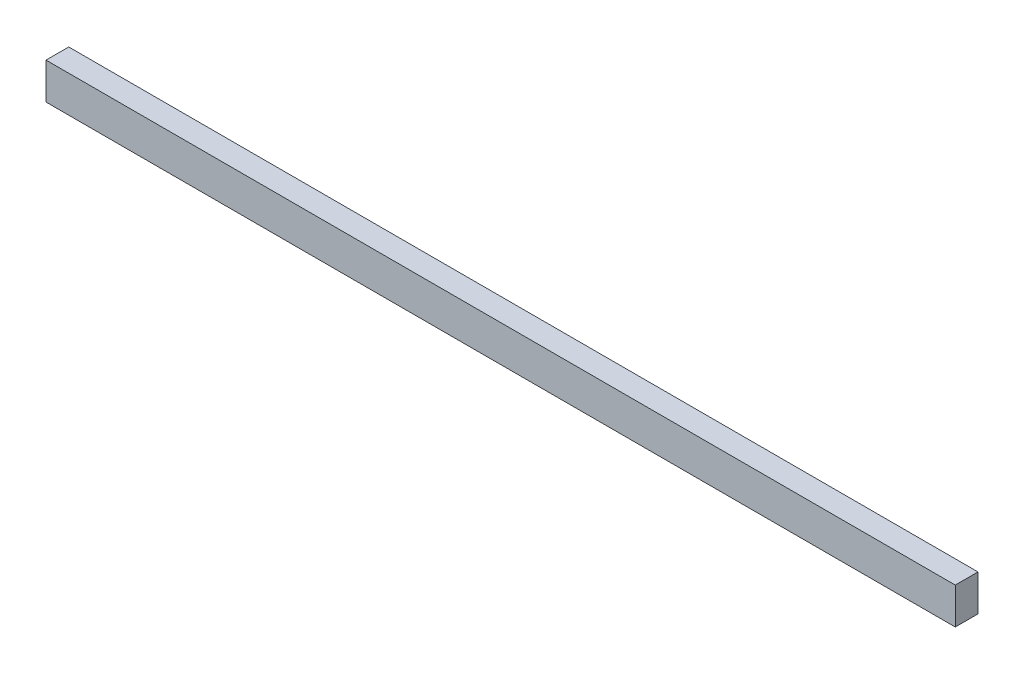
ISO-10303-21;
HEADER;
FILE_DESCRIPTION(('STEP AP214'),'2;1');
FILE_NAME('part.step','',(''),(''),'','','');
FILE_SCHEMA(('AUTOMOTIVE_DESIGN { 1 0 10303 214 1 1 1 1 }'));
ENDSEC;
DATA;
#1=APPLICATION_CONTEXT('core data for automotive mechanical design processes');
#2=APPLICATION_PROTOCOL_DEFINITION('international standard','automotive_design',2000,#1);
#3=PRODUCT_CONTEXT('',#1,'mechanical');
#4=PRODUCT('Part','Part','',(#3));
#5=PRODUCT_RELATED_PRODUCT_CATEGORY('part','',(#4));
#6=PRODUCT_DEFINITION_FORMATION('','',#4);
#7=PRODUCT_DEFINITION_CONTEXT('part definition',#1,'design');
#8=PRODUCT_DEFINITION('design','',#6,#7);
#9=PRODUCT_DEFINITION_SHAPE('','',#8);
#10=(LENGTH_UNIT() NAMED_UNIT(*) SI_UNIT(.MILLI.,.METRE.));
#11=(NAMED_UNIT(*) PLANE_ANGLE_UNIT() SI_UNIT($,.RADIAN.));
#12=(NAMED_UNIT(*) SI_UNIT($,.STERADIAN.) SOLID_ANGLE_UNIT());
#13=UNCERTAINTY_MEASURE_WITH_UNIT(LENGTH_MEASURE(1.E-05),#10,'distance_accuracy_value','');
#14=(GEOMETRIC_REPRESENTATION_CONTEXT(3) GLOBAL_UNCERTAINTY_ASSIGNED_CONTEXT((#13)) GLOBAL_UNIT_ASSIGNED_CONTEXT((#10,
#11,#12)) REPRESENTATION_CONTEXT('',''));
#15=CARTESIAN_POINT('',(0.,0.,0.));
#16=DIRECTION('',(0.,0.,1.));
#17=DIRECTION('',(1.,0.,0.));
#18=AXIS2_PLACEMENT_3D('',#15,#16,#17);
#19=CARTESIAN_POINT('',(0.,0.,6.35));
#20=DIRECTION('',(-1.,0.,0.));
#21=DIRECTION('',(0.,0.,1.));
#22=AXIS2_PLACEMENT_3D('',#19,#20,#21);
#23=PLANE('',#22);
#24=DIRECTION('',(0.,1.,0.));
#25=VECTOR('',#24,1.);
#26=CARTESIAN_POINT('',(0.,0.,0.));
#27=LINE('',#26,#25);
#28=CARTESIAN_POINT('',(0.,0.,0.));
#29=VERTEX_POINT('',#28);
#30=CARTESIAN_POINT('',(0.,10.16,0.));
#31=VERTEX_POINT('',#30);
#32=EDGE_CURVE('E110',#29,#31,#27,.T.);
#33=ORIENTED_EDGE('',*,*,#32,.F.);
#34=DIRECTION('',(0.,0.,-1.));
#35=VECTOR('',#34,1.);
#36=CARTESIAN_POINT('',(0.,0.,6.35));
#37=LINE('',#36,#35);
#38=CARTESIAN_POINT('',(0.,0.,6.35));
#39=VERTEX_POINT('',#38);
#40=EDGE_CURVE('E11',#39,#29,#37,.T.);
#41=ORIENTED_EDGE('',*,*,#40,.F.);
#42=DIRECTION('',(0.,1.,0.));
#43=VECTOR('',#42,1.);
#44=CARTESIAN_POINT('',(0.,0.,6.35));
#45=LINE('',#44,#43);
#46=CARTESIAN_POINT('',(0.,10.16,6.35));
#47=VERTEX_POINT('',#46);
#48=EDGE_CURVE('E103',#39,#47,#45,.T.);
#49=ORIENTED_EDGE('',*,*,#48,.T.);
#50=DIRECTION('',(0.,0.,-1.));
#51=VECTOR('',#50,1.);
#52=CARTESIAN_POINT('',(0.,10.16,6.35));
#53=LINE('',#52,#51);
#54=EDGE_CURVE('E42',#47,#31,#53,.T.);
#55=ORIENTED_EDGE('',*,*,#54,.T.);
#56=EDGE_LOOP('',(#33,#41,#49,#55));
#57=FACE_BOUND('',#56,.T.);
#58=ADVANCED_FACE('F39',(#57),#23,.T.);
#59=CARTESIAN_POINT('',(0.,0.,6.35));
#60=DIRECTION('',(0.,1.,0.));
#61=DIRECTION('',(0.,0.,1.));
#62=AXIS2_PLACEMENT_3D('',#59,#60,#61);
#63=PLANE('',#62);
#64=DIRECTION('',(1.,0.,0.));
#65=VECTOR('',#64,1.);
#66=CARTESIAN_POINT('',(0.,0.,0.));
#67=LINE('',#66,#65);
#68=CARTESIAN_POINT('',(254.,0.,0.));
#69=VERTEX_POINT('',#68);
#70=EDGE_CURVE('E73',#29,#69,#67,.T.);
#71=ORIENTED_EDGE('',*,*,#70,.T.);
#72=DIRECTION('',(0.,0.,-1.));
#73=VECTOR('',#72,1.);
#74=CARTESIAN_POINT('',(254.,0.,6.35));
#75=LINE('',#74,#73);
#76=CARTESIAN_POINT('',(254.,0.,6.35));
#77=VERTEX_POINT('',#76);
#78=EDGE_CURVE('E49',#77,#69,#75,.T.);
#79=ORIENTED_EDGE('',*,*,#78,.F.);
#80=DIRECTION('',(1.,0.,0.));
#81=VECTOR('',#80,1.);
#82=CARTESIAN_POINT('',(0.,0.,6.35));
#83=LINE('',#82,#81);
#84=EDGE_CURVE('E90',#39,#77,#83,.T.);
#85=ORIENTED_EDGE('',*,*,#84,.F.);
#86=ORIENTED_EDGE('',*,*,#40,.T.);
#87=EDGE_LOOP('',(#71,#79,#85,#86));
#88=FACE_BOUND('',#87,.T.);
#89=ADVANCED_FACE('F126',(#88),#63,.F.);
#90=CARTESIAN_POINT('',(254.,0.,6.35));
#91=DIRECTION('',(-1.,0.,0.));
#92=DIRECTION('',(0.,0.,1.));
#93=AXIS2_PLACEMENT_3D('',#90,#91,#92);
#94=PLANE('',#93);
#95=DIRECTION('',(0.,1.,0.));
#96=VECTOR('',#95,1.);
#97=CARTESIAN_POINT('',(254.,0.,0.));
#98=LINE('',#97,#96);
#99=CARTESIAN_POINT('',(254.,10.16,0.));
#100=VERTEX_POINT('',#99);
#101=EDGE_CURVE('E98',#69,#100,#98,.T.);
#102=ORIENTED_EDGE('',*,*,#101,.T.);
#103=DIRECTION('',(0.,0.,-1.));
#104=VECTOR('',#103,1.);
#105=CARTESIAN_POINT('',(254.,10.16,6.35));
#106=LINE('',#105,#104);
#107=CARTESIAN_POINT('',(254.,10.16,6.35));
#108=VERTEX_POINT('',#107);
#109=EDGE_CURVE('E95',#108,#100,#106,.T.);
#110=ORIENTED_EDGE('',*,*,#109,.F.);
#111=DIRECTION('',(0.,1.,0.));
#112=VECTOR('',#111,1.);
#113=CARTESIAN_POINT('',(254.,0.,6.35));
#114=LINE('',#113,#112);
#115=EDGE_CURVE('E85',#77,#108,#114,.T.);
#116=ORIENTED_EDGE('',*,*,#115,.F.);
#117=ORIENTED_EDGE('',*,*,#78,.T.);
#118=EDGE_LOOP('',(#102,#110,#116,#117));
#119=FACE_BOUND('',#118,.T.);
#120=ADVANCED_FACE('F96',(#119),#94,.F.);
#121=CARTESIAN_POINT('',(0.,10.16,6.35));
#122=DIRECTION('',(0.,1.,0.));
#123=DIRECTION('',(0.,0.,1.));
#124=AXIS2_PLACEMENT_3D('',#121,#122,#123);
#125=PLANE('',#124);
#126=DIRECTION('',(1.,0.,0.));
#127=VECTOR('',#126,1.);
#128=CARTESIAN_POINT('',(0.,10.16,0.));
#129=LINE('',#128,#127);
#130=EDGE_CURVE('E114',#31,#100,#129,.T.);
#131=ORIENTED_EDGE('',*,*,#130,.F.);
#132=ORIENTED_EDGE('',*,*,#54,.F.);
#133=DIRECTION('',(1.,0.,0.));
#134=VECTOR('',#133,1.);
#135=CARTESIAN_POINT('',(0.,10.16,6.35));
#136=LINE('',#135,#134);
#137=EDGE_CURVE('E89',#47,#108,#136,.T.);
#138=ORIENTED_EDGE('',*,*,#137,.T.);
#139=ORIENTED_EDGE('',*,*,#109,.T.);
#140=EDGE_LOOP('',(#131,#132,#138,#139));
#141=FACE_BOUND('',#140,.T.);
#142=ADVANCED_FACE('F101',(#141),#125,.T.);
#143=CARTESIAN_POINT('',(0.,0.,6.35));
#144=DIRECTION('',(0.,0.,-1.));
#145=DIRECTION('',(-1.,0.,0.));
#146=AXIS2_PLACEMENT_3D('',#143,#144,#145);
#147=PLANE('',#146);
#148=ORIENTED_EDGE('',*,*,#48,.F.);
#149=ORIENTED_EDGE('',*,*,#84,.T.);
#150=ORIENTED_EDGE('',*,*,#115,.T.);
#151=ORIENTED_EDGE('',*,*,#137,.F.);
#152=EDGE_LOOP('',(#148,#149,#150,#151));
#153=FACE_BOUND('',#152,.T.);
#154=ADVANCED_FACE('F88',(#153),#147,.F.);
#155=CARTESIAN_POINT('',(0.,0.,0.));
#156=DIRECTION('',(0.,0.,-1.));
#157=DIRECTION('',(-1.,0.,0.));
#158=AXIS2_PLACEMENT_3D('',#155,#156,#157);
#159=PLANE('',#158);
#160=ORIENTED_EDGE('',*,*,#32,.T.);
#161=ORIENTED_EDGE('',*,*,#130,.T.);
#162=ORIENTED_EDGE('',*,*,#101,.F.);
#163=ORIENTED_EDGE('',*,*,#70,.F.);
#164=EDGE_LOOP('',(#160,#161,#162,#163));
#165=FACE_BOUND('',#164,.T.);
#166=ADVANCED_FACE('F123',(#165),#159,.T.);
#167=CLOSED_SHELL('',(#58,#89,#120,#142,#154,#166));
#168=MANIFOLD_SOLID_BREP('B2',#167);
#169=ADVANCED_BREP_SHAPE_REPRESENTATION('',(#18,#168),#14);
#170=SHAPE_DEFINITION_REPRESENTATION(#9,#169);
ENDSEC;
END-ISO-10303-21;
